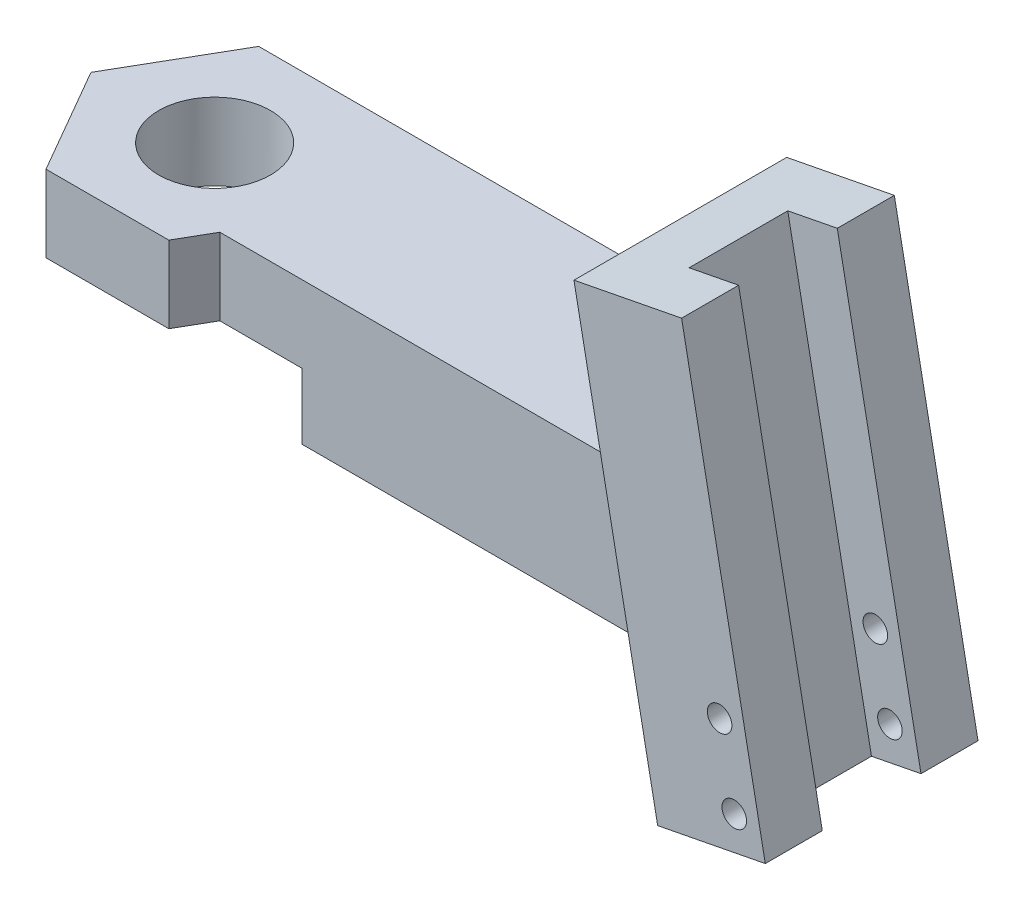
ISO-10303-21;
HEADER;
FILE_DESCRIPTION(('STEP AP214'),'2;1');
FILE_NAME('part.step','',(''),(''),'','','');
FILE_SCHEMA(('AUTOMOTIVE_DESIGN { 1 0 10303 214 1 1 1 1 }'));
ENDSEC;
DATA;
#1=APPLICATION_CONTEXT('core data for automotive mechanical design processes');
#2=APPLICATION_PROTOCOL_DEFINITION('international standard','automotive_design',2000,#1);
#3=PRODUCT_CONTEXT('',#1,'mechanical');
#4=PRODUCT('Part','Part','',(#3));
#5=PRODUCT_RELATED_PRODUCT_CATEGORY('part','',(#4));
#6=PRODUCT_DEFINITION_FORMATION('','',#4);
#7=PRODUCT_DEFINITION_CONTEXT('part definition',#1,'design');
#8=PRODUCT_DEFINITION('design','',#6,#7);
#9=PRODUCT_DEFINITION_SHAPE('','',#8);
#10=(LENGTH_UNIT() NAMED_UNIT(*) SI_UNIT(.MILLI.,.METRE.));
#11=(NAMED_UNIT(*) PLANE_ANGLE_UNIT() SI_UNIT($,.RADIAN.));
#12=(NAMED_UNIT(*) SI_UNIT($,.STERADIAN.) SOLID_ANGLE_UNIT());
#13=UNCERTAINTY_MEASURE_WITH_UNIT(LENGTH_MEASURE(1.E-05),#10,'distance_accuracy_value','');
#14=(GEOMETRIC_REPRESENTATION_CONTEXT(3) GLOBAL_UNCERTAINTY_ASSIGNED_CONTEXT((#13)) GLOBAL_UNIT_ASSIGNED_CONTEXT((#10,
#11,#12)) REPRESENTATION_CONTEXT('',''));
#15=CARTESIAN_POINT('',(0.,0.,0.));
#16=DIRECTION('',(0.,0.,1.));
#17=DIRECTION('',(1.,0.,0.));
#18=AXIS2_PLACEMENT_3D('',#15,#16,#17);
#19=CARTESIAN_POINT('',(2.80014880556968,-14.8169947470239,8.225));
#20=DIRECTION('',(0.866025403784439,0.,0.5));
#21=DIRECTION('',(0.5,0.,-0.866025403784439));
#22=AXIS2_PLACEMENT_3D('',#19,#20,#21);
#23=PLANE('',#22);
#24=DIRECTION('',(0.,1.,0.));
#25=VECTOR('',#24,1.);
#26=CARTESIAN_POINT('',(2.80014880556968,-14.8169947470239,8.225));
#27=LINE('',#26,#25);
#28=CARTESIAN_POINT('',(2.80014880556968,3.,8.225));
#29=VERTEX_POINT('',#28);
#30=CARTESIAN_POINT('',(2.80014880556968,6.5,8.225));
#31=VERTEX_POINT('',#30);
#32=EDGE_CURVE('E297',#29,#31,#27,.T.);
#33=ORIENTED_EDGE('',*,*,#32,.F.);
#34=DIRECTION('',(0.5,0.,-0.866025403784439));
#35=VECTOR('',#34,1.);
#36=CARTESIAN_POINT('',(2.80014880556968,3.,8.225));
#37=LINE('',#36,#35);
#38=CARTESIAN_POINT('',(3.65174045262438,3.,6.75));
#39=VERTEX_POINT('',#38);
#40=EDGE_CURVE('E201',#29,#39,#37,.T.);
#41=ORIENTED_EDGE('',*,*,#40,.T.);
#42=DIRECTION('',(0.,-1.,0.));
#43=VECTOR('',#42,1.);
#44=CARTESIAN_POINT('',(3.65174045262438,6.5,6.75));
#45=LINE('',#44,#43);
#46=CARTESIAN_POINT('',(3.65174045262438,6.5,6.75));
#47=VERTEX_POINT('',#46);
#48=EDGE_CURVE('E279',#47,#39,#45,.T.);
#49=ORIENTED_EDGE('',*,*,#48,.F.);
#50=DIRECTION('',(0.5,0.,-0.866025403784439));
#51=VECTOR('',#50,1.);
#52=CARTESIAN_POINT('',(2.80014880556968,6.5,8.225));
#53=LINE('',#52,#51);
#54=EDGE_CURVE('E289',#31,#47,#53,.T.);
#55=ORIENTED_EDGE('',*,*,#54,.F.);
#56=EDGE_LOOP('',(#33,#41,#49,#55));
#57=FACE_BOUND('',#56,.T.);
#58=ADVANCED_FACE('F37',(#57),#23,.T.);
#59=CARTESIAN_POINT('',(-2.80014880556969,-14.8169947470239,-1.475));
#60=DIRECTION('',(-0.866025403784439,0.,-0.5));
#61=DIRECTION('',(-0.5,0.,0.866025403784439));
#62=AXIS2_PLACEMENT_3D('',#59,#60,#61);
#63=PLANE('',#62);
#64=DIRECTION('',(0.,1.,0.));
#65=VECTOR('',#64,1.);
#66=CARTESIAN_POINT('',(-2.80014880556969,-14.8169947470239,-1.475));
#67=LINE('',#66,#65);
#68=CARTESIAN_POINT('',(-2.80014880556969,3.,-1.475));
#69=VERTEX_POINT('',#68);
#70=CARTESIAN_POINT('',(-2.80014880556969,6.5,-1.475));
#71=VERTEX_POINT('',#70);
#72=EDGE_CURVE('E280',#69,#71,#67,.T.);
#73=ORIENTED_EDGE('',*,*,#72,.F.);
#74=DIRECTION('',(-0.5,0.,0.866025403784439));
#75=VECTOR('',#74,1.);
#76=CARTESIAN_POINT('',(-2.80014880556969,3.,-1.475));
#77=LINE('',#76,#75);
#78=CARTESIAN_POINT('',(-5.60029761113937,3.,3.375));
#79=VERTEX_POINT('',#78);
#80=EDGE_CURVE('E198',#69,#79,#77,.T.);
#81=ORIENTED_EDGE('',*,*,#80,.T.);
#82=DIRECTION('',(0.,1.,0.));
#83=VECTOR('',#82,1.);
#84=CARTESIAN_POINT('',(-5.60029761113937,-14.8169947470239,3.375));
#85=LINE('',#84,#83);
#86=CARTESIAN_POINT('',(-5.60029761113937,6.5,3.375));
#87=VERTEX_POINT('',#86);
#88=EDGE_CURVE('E295',#79,#87,#85,.T.);
#89=ORIENTED_EDGE('',*,*,#88,.T.);
#90=DIRECTION('',(-0.5,0.,0.866025403784439));
#91=VECTOR('',#90,1.);
#92=CARTESIAN_POINT('',(-2.80014880556969,6.5,-1.475));
#93=LINE('',#92,#91);
#94=EDGE_CURVE('E277',#71,#87,#93,.T.);
#95=ORIENTED_EDGE('',*,*,#94,.F.);
#96=EDGE_LOOP('',(#73,#81,#89,#95));
#97=FACE_BOUND('',#96,.T.);
#98=ADVANCED_FACE('F360',(#97),#63,.T.);
#99=CARTESIAN_POINT('',(-2.80014880556968,-14.8169947470239,8.225));
#100=DIRECTION('',(0.,0.,1.));
#101=DIRECTION('',(1.,0.,0.));
#102=AXIS2_PLACEMENT_3D('',#99,#100,#101);
#103=PLANE('',#102);
#104=DIRECTION('',(0.,1.,0.));
#105=VECTOR('',#104,1.);
#106=CARTESIAN_POINT('',(-2.80014880556968,-14.8169947470239,8.225));
#107=LINE('',#106,#105);
#108=CARTESIAN_POINT('',(-2.80014880556968,3.,8.225));
#109=VERTEX_POINT('',#108);
#110=CARTESIAN_POINT('',(-2.80014880556968,6.5,8.225));
#111=VERTEX_POINT('',#110);
#112=EDGE_CURVE('E299',#109,#111,#107,.T.);
#113=ORIENTED_EDGE('',*,*,#112,.F.);
#114=DIRECTION('',(1.,0.,0.));
#115=VECTOR('',#114,1.);
#116=CARTESIAN_POINT('',(-2.80014880556968,3.,8.225));
#117=LINE('',#116,#115);
#118=EDGE_CURVE('E54',#109,#29,#117,.T.);
#119=ORIENTED_EDGE('',*,*,#118,.T.);
#120=ORIENTED_EDGE('',*,*,#32,.T.);
#121=DIRECTION('',(1.,0.,0.));
#122=VECTOR('',#121,1.);
#123=CARTESIAN_POINT('',(-2.80014880556968,6.5,8.225));
#124=LINE('',#123,#122);
#125=EDGE_CURVE('E286',#111,#31,#124,.T.);
#126=ORIENTED_EDGE('',*,*,#125,.F.);
#127=EDGE_LOOP('',(#113,#119,#120,#126));
#128=FACE_BOUND('',#127,.T.);
#129=ADVANCED_FACE('F354',(#128),#103,.T.);
#130=CARTESIAN_POINT('',(-5.60029761113937,-14.8169947470239,3.375));
#131=DIRECTION('',(-0.866025403784439,0.,0.5));
#132=DIRECTION('',(0.5,0.,0.866025403784439));
#133=AXIS2_PLACEMENT_3D('',#130,#131,#132);
#134=PLANE('',#133);
#135=ORIENTED_EDGE('',*,*,#88,.F.);
#136=DIRECTION('',(0.5,0.,0.866025403784439));
#137=VECTOR('',#136,1.);
#138=CARTESIAN_POINT('',(-5.60029761113937,3.,3.375));
#139=LINE('',#138,#137);
#140=EDGE_CURVE('E195',#79,#109,#139,.T.);
#141=ORIENTED_EDGE('',*,*,#140,.T.);
#142=ORIENTED_EDGE('',*,*,#112,.T.);
#143=DIRECTION('',(0.5,0.,0.866025403784439));
#144=VECTOR('',#143,1.);
#145=CARTESIAN_POINT('',(-5.60029761113937,6.5,3.375));
#146=LINE('',#145,#144);
#147=EDGE_CURVE('E283',#87,#111,#146,.T.);
#148=ORIENTED_EDGE('',*,*,#147,.F.);
#149=EDGE_LOOP('',(#135,#141,#142,#148));
#150=FACE_BOUND('',#149,.T.);
#151=ADVANCED_FACE('F358',(#150),#134,.T.);
#152=CARTESIAN_POINT('',(0.,-3.5,3.33561597332667));
#153=DIRECTION('',(0.,1.,0.));
#154=DIRECTION('',(0.,0.,1.));
#155=AXIS2_PLACEMENT_3D('',#152,#153,#154);
#156=CYLINDRICAL_SURFACE('',#155,2.55);
#157=CARTESIAN_POINT('',(0.,6.5,3.33561597332667));
#158=DIRECTION('',(0.,1.,0.));
#159=DIRECTION('',(0.,0.,1.));
#160=AXIS2_PLACEMENT_3D('',#157,#158,#159);
#161=CIRCLE('',#160,2.55);
#162=CARTESIAN_POINT('',(0.,6.5,5.88561597332667));
#163=VERTEX_POINT('',#162);
#164=EDGE_CURVE('E208',#163,#163,#161,.T.);
#165=ORIENTED_EDGE('',*,*,#164,.T.);
#166=EDGE_LOOP('',(#165));
#167=FACE_BOUND('',#166,.T.);
#168=CARTESIAN_POINT('',(0.,3.,3.33561597332667));
#169=DIRECTION('',(0.,-1.,0.));
#170=DIRECTION('',(0.,0.,-1.));
#171=AXIS2_PLACEMENT_3D('',#168,#169,#170);
#172=CIRCLE('',#171,2.55);
#173=CARTESIAN_POINT('',(0.,3.,0.78561597332667));
#174=VERTEX_POINT('',#173);
#175=EDGE_CURVE('E182',#174,#174,#172,.F.);
#176=ORIENTED_EDGE('',*,*,#175,.F.);
#177=EDGE_LOOP('',(#176));
#178=FACE_BOUND('',#177,.T.);
#179=ADVANCED_FACE('F388',(#167,#178),#156,.F.);
#180=CARTESIAN_POINT('',(30.,-4.52297751155863,-23.8339203380482));
#181=DIRECTION('',(0.190808995376549,-0.981627183447663,0.));
#182=DIRECTION('',(0.981627183447663,0.190808995376549,0.));
#183=AXIS2_PLACEMENT_3D('',#180,#181,#182);
#184=PLANE('',#183);
#185=DIRECTION('',(0.981627183447663,0.190808995376549,0.));
#186=VECTOR('',#185,1.);
#187=CARTESIAN_POINT('',(30.,-4.52297751155863,8.225));
#188=LINE('',#187,#186);
#189=CARTESIAN_POINT('',(25.0918640827617,-5.47702248844137,8.225));
#190=VERTEX_POINT('',#189);
#191=CARTESIAN_POINT('',(30.,-4.52297751155863,8.225));
#192=VERTEX_POINT('',#191);
#193=EDGE_CURVE('E242',#190,#192,#188,.T.);
#194=ORIENTED_EDGE('',*,*,#193,.F.);
#195=DIRECTION('',(0.,0.,1.));
#196=VECTOR('',#195,1.);
#197=CARTESIAN_POINT('',(25.0918640827617,-5.47702248844137,-23.8339203380482));
#198=LINE('',#197,#196);
#199=CARTESIAN_POINT('',(25.0918640827617,-5.47702248844137,-1.475));
#200=VERTEX_POINT('',#199);
#201=EDGE_CURVE('E256',#200,#190,#198,.T.);
#202=ORIENTED_EDGE('',*,*,#201,.F.);
#203=DIRECTION('',(0.981627183447663,0.190808995376549,0.));
#204=VECTOR('',#203,1.);
#205=CARTESIAN_POINT('',(30.,-4.52297751155863,-1.475));
#206=LINE('',#205,#204);
#207=CARTESIAN_POINT('',(30.,-4.52297751155863,-1.475));
#208=VERTEX_POINT('',#207);
#209=EDGE_CURVE('E241',#200,#208,#206,.T.);
#210=ORIENTED_EDGE('',*,*,#209,.T.);
#211=DIRECTION('',(0.,0.,1.));
#212=VECTOR('',#211,1.);
#213=CARTESIAN_POINT('',(30.,-4.52297751155863,-23.8339203380482));
#214=LINE('',#213,#212);
#215=CARTESIAN_POINT('',(30.,-4.52297751155862,1.12499999999999));
#216=VERTEX_POINT('',#215);
#217=EDGE_CURVE('E267',#208,#216,#214,.T.);
#218=ORIENTED_EDGE('',*,*,#217,.T.);
#219=DIRECTION('',(-0.981627183447663,-0.190808995376549,0.));
#220=VECTOR('',#219,1.);
#221=CARTESIAN_POINT('',(30.0000000000001,-4.52297751155861,1.12499999999999));
#222=LINE('',#221,#220);
#223=CARTESIAN_POINT('',(27.7422574780704,-4.96183820092469,1.125));
#224=VERTEX_POINT('',#223);
#225=EDGE_CURVE('E234',#216,#224,#222,.T.);
#226=ORIENTED_EDGE('',*,*,#225,.T.);
#227=DIRECTION('',(0.,0.,-1.));
#228=VECTOR('',#227,1.);
#229=CARTESIAN_POINT('',(27.7422574780704,-4.96183820092469,-23.8339203380482));
#230=LINE('',#229,#228);
#231=CARTESIAN_POINT('',(27.7422574780704,-4.96183820092469,5.625));
#232=VERTEX_POINT('',#231);
#233=EDGE_CURVE('E230',#232,#224,#230,.T.);
#234=ORIENTED_EDGE('',*,*,#233,.F.);
#235=DIRECTION('',(-0.981627183447663,-0.190808995376549,0.));
#236=VECTOR('',#235,1.);
#237=CARTESIAN_POINT('',(29.9999999999999,-4.52297751155864,5.62500000000001));
#238=LINE('',#237,#236);
#239=CARTESIAN_POINT('',(30.,-4.52297751155862,5.625));
#240=VERTEX_POINT('',#239);
#241=EDGE_CURVE('E232',#240,#232,#238,.T.);
#242=ORIENTED_EDGE('',*,*,#241,.F.);
#243=EDGE_CURVE('E252',#240,#192,#214,.T.);
#244=ORIENTED_EDGE('',*,*,#243,.T.);
#245=EDGE_LOOP('',(#194,#202,#210,#218,#226,#234,#242,#244));
#246=FACE_BOUND('',#245,.T.);
#247=ADVANCED_FACE('F381',(#246),#184,.T.);
#248=CARTESIAN_POINT('',(26.183820092469,15.1095661573946,-23.8339203380482));
#249=DIRECTION('',(0.981627183447663,0.190808995376549,0.));
#250=DIRECTION('',(-0.190808995376549,0.981627183447663,0.));
#251=AXIS2_PLACEMENT_3D('',#248,#249,#250);
#252=PLANE('',#251);
#253=DIRECTION('',(-0.190808995376549,0.981627183447663,0.));
#254=VECTOR('',#253,1.);
#255=CARTESIAN_POINT('',(30.5724269861296,-7.4678590619016,1.12499999999999));
#256=LINE('',#255,#254);
#257=CARTESIAN_POINT('',(26.183820092469,15.1095661573946,1.12499999999999));
#258=VERTEX_POINT('',#257);
#259=EDGE_CURVE('E227',#216,#258,#256,.T.);
#260=ORIENTED_EDGE('',*,*,#259,.F.);
#261=ORIENTED_EDGE('',*,*,#217,.F.);
#262=DIRECTION('',(-0.190808995376549,0.981627183447663,0.));
#263=VECTOR('',#262,1.);
#264=CARTESIAN_POINT('',(26.183820092469,15.1095661573946,-1.475));
#265=LINE('',#264,#263);
#266=CARTESIAN_POINT('',(26.183820092469,15.1095661573946,-1.475));
#267=VERTEX_POINT('',#266);
#268=EDGE_CURVE('E263',#208,#267,#265,.T.);
#269=ORIENTED_EDGE('',*,*,#268,.T.);
#270=DIRECTION('',(0.,0.,1.));
#271=VECTOR('',#270,1.);
#272=CARTESIAN_POINT('',(26.183820092469,15.1095661573946,-23.8339203380482));
#273=LINE('',#272,#271);
#274=EDGE_CURVE('E262',#267,#258,#273,.T.);
#275=ORIENTED_EDGE('',*,*,#274,.T.);
#276=EDGE_LOOP('',(#260,#261,#269,#275));
#277=FACE_BOUND('',#276,.T.);
#278=ADVANCED_FACE('F377',(#277),#252,.T.);
#279=CARTESIAN_POINT('',(21.2756841752307,14.1555211805119,-23.8339203380482));
#280=DIRECTION('',(-0.190808995376549,0.981627183447663,0.));
#281=DIRECTION('',(-0.981627183447663,-0.190808995376549,0.));
#282=AXIS2_PLACEMENT_3D('',#279,#280,#281);
#283=PLANE('',#282);
#284=DIRECTION('',(0.981627183447663,0.190808995376549,0.));
#285=VECTOR('',#284,1.);
#286=CARTESIAN_POINT('',(23.9260775705394,14.6707054680286,1.125));
#287=LINE('',#286,#285);
#288=CARTESIAN_POINT('',(23.9260775705394,14.6707054680286,1.125));
#289=VERTEX_POINT('',#288);
#290=EDGE_CURVE('E211',#289,#258,#287,.T.);
#291=ORIENTED_EDGE('',*,*,#290,.T.);
#292=ORIENTED_EDGE('',*,*,#274,.F.);
#293=DIRECTION('',(-0.981627183447663,-0.190808995376549,0.));
#294=VECTOR('',#293,1.);
#295=CARTESIAN_POINT('',(21.2756841752307,14.1555211805119,-1.475));
#296=LINE('',#295,#294);
#297=CARTESIAN_POINT('',(21.2756841752307,14.1555211805119,-1.475));
#298=VERTEX_POINT('',#297);
#299=EDGE_CURVE('E258',#267,#298,#296,.T.);
#300=ORIENTED_EDGE('',*,*,#299,.T.);
#301=DIRECTION('',(0.,0.,1.));
#302=VECTOR('',#301,1.);
#303=CARTESIAN_POINT('',(21.2756841752307,14.1555211805119,-23.8339203380482));
#304=LINE('',#303,#302);
#305=CARTESIAN_POINT('',(21.2756841752307,14.1555211805119,8.225));
#306=VERTEX_POINT('',#305);
#307=EDGE_CURVE('E261',#298,#306,#304,.T.);
#308=ORIENTED_EDGE('',*,*,#307,.T.);
#309=DIRECTION('',(-0.981627183447663,-0.190808995376549,0.));
#310=VECTOR('',#309,1.);
#311=CARTESIAN_POINT('',(21.2756841752307,14.1555211805119,8.225));
#312=LINE('',#311,#310);
#313=CARTESIAN_POINT('',(26.183820092469,15.1095661573946,8.225));
#314=VERTEX_POINT('',#313);
#315=EDGE_CURVE('E237',#314,#306,#312,.T.);
#316=ORIENTED_EDGE('',*,*,#315,.F.);
#317=CARTESIAN_POINT('',(26.183820092469,15.1095661573946,5.625));
#318=VERTEX_POINT('',#317);
#319=EDGE_CURVE('E266',#318,#314,#273,.T.);
#320=ORIENTED_EDGE('',*,*,#319,.F.);
#321=DIRECTION('',(0.981627183447663,0.190808995376549,0.));
#322=VECTOR('',#321,1.);
#323=CARTESIAN_POINT('',(23.9260775705394,14.6707054680286,5.625));
#324=LINE('',#323,#322);
#325=CARTESIAN_POINT('',(23.9260775705394,14.6707054680286,5.625));
#326=VERTEX_POINT('',#325);
#327=EDGE_CURVE('E214',#326,#318,#324,.T.);
#328=ORIENTED_EDGE('',*,*,#327,.F.);
#329=DIRECTION('',(0.,0.,1.));
#330=VECTOR('',#329,1.);
#331=CARTESIAN_POINT('',(23.9260775705394,14.6707054680286,1.125));
#332=LINE('',#331,#330);
#333=EDGE_CURVE('E216',#289,#326,#332,.T.);
#334=ORIENTED_EDGE('',*,*,#333,.F.);
#335=EDGE_LOOP('',(#291,#292,#300,#308,#316,#320,#328,#334));
#336=FACE_BOUND('',#335,.T.);
#337=ADVANCED_FACE('F371',(#336),#283,.T.);
#338=DIRECTION('',(-0.190808995376549,0.981627183447663,0.));
#339=VECTOR('',#338,1.);
#340=CARTESIAN_POINT('',(30.5724269861296,-7.4678590619016,5.625));
#341=LINE('',#340,#339);
#342=EDGE_CURVE('E224',#240,#318,#341,.T.);
#343=ORIENTED_EDGE('',*,*,#342,.T.);
#344=ORIENTED_EDGE('',*,*,#319,.T.);
#345=DIRECTION('',(-0.190808995376549,0.981627183447663,0.));
#346=VECTOR('',#345,1.);
#347=CARTESIAN_POINT('',(26.183820092469,15.1095661573946,8.225));
#348=LINE('',#347,#346);
#349=EDGE_CURVE('E238',#192,#314,#348,.T.);
#350=ORIENTED_EDGE('',*,*,#349,.F.);
#351=ORIENTED_EDGE('',*,*,#243,.F.);
#352=EDGE_LOOP('',(#343,#344,#350,#351));
#353=FACE_BOUND('',#352,.T.);
#354=ADVANCED_FACE('F535',(#353),#252,.T.);
#355=CARTESIAN_POINT('',(25.0918640827617,-5.47702248844137,-23.8339203380482));
#356=DIRECTION('',(-0.981627183447663,-0.19080899537655,0.));
#357=DIRECTION('',(0.19080899537655,-0.981627183447663,0.));
#358=AXIS2_PLACEMENT_3D('',#355,#356,#357);
#359=PLANE('',#358);
#360=DIRECTION('',(0.19080899537655,-0.981627183447663,0.));
#361=VECTOR('',#360,1.);
#362=CARTESIAN_POINT('',(25.0918640827617,-5.47702248844137,8.225));
#363=LINE('',#362,#361);
#364=EDGE_CURVE('E245',#306,#190,#363,.T.);
#365=ORIENTED_EDGE('',*,*,#364,.F.);
#366=ORIENTED_EDGE('',*,*,#307,.F.);
#367=DIRECTION('',(0.19080899537655,-0.981627183447663,0.));
#368=VECTOR('',#367,1.);
#369=CARTESIAN_POINT('',(25.0918640827617,-5.47702248844137,-1.475));
#370=LINE('',#369,#368);
#371=CARTESIAN_POINT('',(22.763766748909,6.5,-1.475));
#372=VERTEX_POINT('',#371);
#373=EDGE_CURVE('E253',#298,#372,#370,.T.);
#374=ORIENTED_EDGE('',*,*,#373,.T.);
#375=DIRECTION('',(0.,0.,1.));
#376=VECTOR('',#375,1.);
#377=CARTESIAN_POINT('',(22.763766748909,6.5,0.));
#378=LINE('',#377,#376);
#379=CARTESIAN_POINT('',(22.763766748909,6.5,6.75));
#380=VERTEX_POINT('',#379);
#381=EDGE_CURVE('E275',#372,#380,#378,.T.);
#382=ORIENTED_EDGE('',*,*,#381,.T.);
#383=DIRECTION('',(-0.19080899537655,0.981627183447663,0.));
#384=VECTOR('',#383,1.);
#385=CARTESIAN_POINT('',(21.9349818738108,10.7637285575617,6.75));
#386=LINE('',#385,#384);
#387=CARTESIAN_POINT('',(24.0272387583042,0.,6.75));
#388=VERTEX_POINT('',#387);
#389=EDGE_CURVE('E272',#388,#380,#386,.T.);
#390=ORIENTED_EDGE('',*,*,#389,.F.);
#391=DIRECTION('',(0.,0.,1.));
#392=VECTOR('',#391,1.);
#393=CARTESIAN_POINT('',(24.0272387583042,0.,0.));
#394=LINE('',#393,#392);
#395=CARTESIAN_POINT('',(24.0272387583042,0.,-1.475));
#396=VERTEX_POINT('',#395);
#397=EDGE_CURVE('E46',#396,#388,#394,.T.);
#398=ORIENTED_EDGE('',*,*,#397,.F.);
#399=EDGE_CURVE('E257',#396,#200,#370,.T.);
#400=ORIENTED_EDGE('',*,*,#399,.T.);
#401=ORIENTED_EDGE('',*,*,#201,.T.);
#402=EDGE_LOOP('',(#365,#366,#374,#382,#390,#398,#400,#401));
#403=FACE_BOUND('',#402,.T.);
#404=ADVANCED_FACE('F367',(#403),#359,.T.);
#405=CARTESIAN_POINT('',(-2.80014880556968,-14.8169947470239,8.225));
#406=DIRECTION('',(0.,0.,1.));
#407=DIRECTION('',(1.,0.,0.));
#408=AXIS2_PLACEMENT_3D('',#405,#406,#407);
#409=PLANE('',#408);
#410=CARTESIAN_POINT('',(28.5849152459704,-3.26996708107016,8.225));
#411=DIRECTION('',(0.,0.,1.));
#412=DIRECTION('',(1.,0.,0.));
#413=AXIS2_PLACEMENT_3D('',#410,#411,#412);
#414=CIRCLE('',#413,0.560000000000003);
#415=CARTESIAN_POINT('',(29.1449152459704,-3.26996708107016,8.225));
#416=VERTEX_POINT('',#415);
#417=EDGE_CURVE('E314',#416,#416,#414,.F.);
#418=ORIENTED_EDGE('',*,*,#417,.T.);
#419=EDGE_LOOP('',(#418));
#420=FACE_BOUND('',#419,.T.);
#421=CARTESIAN_POINT('',(27.9170837621524,0.165728060996657,8.225));
#422=DIRECTION('',(0.,0.,1.));
#423=DIRECTION('',(1.,0.,0.));
#424=AXIS2_PLACEMENT_3D('',#421,#422,#423);
#425=CIRCLE('',#424,0.560000000000003);
#426=CARTESIAN_POINT('',(28.4770837621524,0.165728060996657,8.225));
#427=VERTEX_POINT('',#426);
#428=EDGE_CURVE('E327',#427,#427,#425,.F.);
#429=ORIENTED_EDGE('',*,*,#428,.T.);
#430=EDGE_LOOP('',(#429));
#431=FACE_BOUND('',#430,.T.);
#432=ORIENTED_EDGE('',*,*,#315,.T.);
#433=ORIENTED_EDGE('',*,*,#364,.T.);
#434=ORIENTED_EDGE('',*,*,#193,.T.);
#435=ORIENTED_EDGE('',*,*,#349,.T.);
#436=EDGE_LOOP('',(#432,#433,#434,#435));
#437=FACE_BOUND('',#436,.T.);
#438=ADVANCED_FACE('F476',(#420,#431,#437),#409,.T.);
#439=CARTESIAN_POINT('',(0.,6.5,6.75));
#440=DIRECTION('',(0.,0.,-1.));
#441=DIRECTION('',(-1.,0.,0.));
#442=AXIS2_PLACEMENT_3D('',#439,#440,#441);
#443=PLANE('',#442);
#444=DIRECTION('',(-1.,0.,0.));
#445=VECTOR('',#444,1.);
#446=CARTESIAN_POINT('',(0.,3.,6.75));
#447=LINE('',#446,#445);
#448=CARTESIAN_POINT('',(7.40451720235695,3.,6.75));
#449=VERTEX_POINT('',#448);
#450=EDGE_CURVE('E204',#449,#39,#447,.T.);
#451=ORIENTED_EDGE('',*,*,#450,.F.);
#452=DIRECTION('',(0.,-1.,0.));
#453=VECTOR('',#452,1.);
#454=CARTESIAN_POINT('',(7.40451720235695,6.5,6.75));
#455=LINE('',#454,#453);
#456=CARTESIAN_POINT('',(7.40451720235695,0.,6.75));
#457=VERTEX_POINT('',#456);
#458=EDGE_CURVE('E186',#449,#457,#455,.T.);
#459=ORIENTED_EDGE('',*,*,#458,.T.);
#460=DIRECTION('',(1.,0.,0.));
#461=VECTOR('',#460,1.);
#462=CARTESIAN_POINT('',(0.,0.,6.75));
#463=LINE('',#462,#461);
#464=EDGE_CURVE('E304',#457,#388,#463,.T.);
#465=ORIENTED_EDGE('',*,*,#464,.T.);
#466=ORIENTED_EDGE('',*,*,#389,.T.);
#467=DIRECTION('',(1.,0.,0.));
#468=VECTOR('',#467,1.);
#469=CARTESIAN_POINT('',(0.,6.5,6.75));
#470=LINE('',#469,#468);
#471=EDGE_CURVE('E305',#47,#380,#470,.T.);
#472=ORIENTED_EDGE('',*,*,#471,.F.);
#473=ORIENTED_EDGE('',*,*,#48,.T.);
#474=EDGE_LOOP('',(#451,#459,#465,#466,#472,#473));
#475=FACE_BOUND('',#474,.T.);
#476=ADVANCED_FACE('F39',(#475),#443,.F.);
#477=CARTESIAN_POINT('',(0.,6.5,0.));
#478=DIRECTION('',(0.,1.,0.));
#479=DIRECTION('',(0.,0.,1.));
#480=AXIS2_PLACEMENT_3D('',#477,#478,#479);
#481=PLANE('',#480);
#482=ORIENTED_EDGE('',*,*,#381,.F.);
#483=DIRECTION('',(-1.,0.,0.));
#484=VECTOR('',#483,1.);
#485=CARTESIAN_POINT('',(2.80014880556968,6.5,-1.475));
#486=LINE('',#485,#484);
#487=EDGE_CURVE('E292',#372,#71,#486,.T.);
#488=ORIENTED_EDGE('',*,*,#487,.T.);
#489=ORIENTED_EDGE('',*,*,#94,.T.);
#490=ORIENTED_EDGE('',*,*,#147,.T.);
#491=ORIENTED_EDGE('',*,*,#125,.T.);
#492=ORIENTED_EDGE('',*,*,#54,.T.);
#493=ORIENTED_EDGE('',*,*,#471,.T.);
#494=EDGE_LOOP('',(#482,#488,#489,#490,#491,#492,#493));
#495=FACE_BOUND('',#494,.T.);
#496=ORIENTED_EDGE('',*,*,#164,.F.);
#497=EDGE_LOOP('',(#496));
#498=FACE_BOUND('',#497,.T.);
#499=ADVANCED_FACE('F382',(#495,#498),#481,.T.);
#500=CARTESIAN_POINT('',(0.,0.,0.));
#501=DIRECTION('',(0.,1.,0.));
#502=DIRECTION('',(0.,0.,1.));
#503=AXIS2_PLACEMENT_3D('',#500,#501,#502);
#504=PLANE('',#503);
#505=ORIENTED_EDGE('',*,*,#464,.F.);
#506=DIRECTION('',(-0.5,0.,0.866025403784439));
#507=VECTOR('',#506,1.);
#508=CARTESIAN_POINT('',(9.35307436087194,0.,3.375));
#509=LINE('',#508,#507);
#510=CARTESIAN_POINT('',(9.35307436087194,0.,3.375));
#511=VERTEX_POINT('',#510);
#512=EDGE_CURVE('E188',#511,#457,#509,.T.);
#513=ORIENTED_EDGE('',*,*,#512,.F.);
#514=DIRECTION('',(0.5,0.,0.866025403784439));
#515=VECTOR('',#514,1.);
#516=CARTESIAN_POINT('',(4.67653718043597,0.,-4.725));
#517=LINE('',#516,#515);
#518=CARTESIAN_POINT('',(6.55292555530225,0.,-1.475));
#519=VERTEX_POINT('',#518);
#520=EDGE_CURVE('E179',#519,#511,#517,.T.);
#521=ORIENTED_EDGE('',*,*,#520,.F.);
#522=DIRECTION('',(1.,0.,0.));
#523=VECTOR('',#522,1.);
#524=CARTESIAN_POINT('',(2.80014880556968,0.,-1.475));
#525=LINE('',#524,#523);
#526=EDGE_CURVE('E62',#519,#396,#525,.T.);
#527=ORIENTED_EDGE('',*,*,#526,.T.);
#528=ORIENTED_EDGE('',*,*,#397,.T.);
#529=EDGE_LOOP('',(#505,#513,#521,#527,#528));
#530=FACE_BOUND('',#529,.T.);
#531=ADVANCED_FACE('F339',(#530),#504,.F.);
#532=CARTESIAN_POINT('',(2.80014880556968,-14.8169947470239,-1.475));
#533=DIRECTION('',(0.,0.,-1.));
#534=DIRECTION('',(-1.,0.,0.));
#535=AXIS2_PLACEMENT_3D('',#532,#533,#534);
#536=PLANE('',#535);
#537=CARTESIAN_POINT('',(28.5849152459704,-3.26996708107016,-1.475));
#538=DIRECTION('',(0.,0.,-1.));
#539=DIRECTION('',(-1.,0.,0.));
#540=AXIS2_PLACEMENT_3D('',#537,#538,#539);
#541=CIRCLE('',#540,0.560000000000003);
#542=CARTESIAN_POINT('',(28.0249152459704,-3.26996708107016,-1.475));
#543=VERTEX_POINT('',#542);
#544=EDGE_CURVE('E319',#543,#543,#541,.T.);
#545=ORIENTED_EDGE('',*,*,#544,.F.);
#546=EDGE_LOOP('',(#545));
#547=FACE_BOUND('',#546,.T.);
#548=CARTESIAN_POINT('',(27.9170837621524,0.165728060996657,-1.475));
#549=DIRECTION('',(0.,0.,-1.));
#550=DIRECTION('',(-1.,0.,0.));
#551=AXIS2_PLACEMENT_3D('',#548,#549,#550);
#552=CIRCLE('',#551,0.560000000000003);
#553=CARTESIAN_POINT('',(27.3570837621524,0.165728060996657,-1.475));
#554=VERTEX_POINT('',#553);
#555=EDGE_CURVE('E324',#554,#554,#552,.T.);
#556=ORIENTED_EDGE('',*,*,#555,.F.);
#557=EDGE_LOOP('',(#556));
#558=FACE_BOUND('',#557,.T.);
#559=DIRECTION('',(0.,-1.,0.));
#560=VECTOR('',#559,1.);
#561=CARTESIAN_POINT('',(6.55292555530225,-14.8169947470239,-1.475));
#562=LINE('',#561,#560);
#563=CARTESIAN_POINT('',(6.55292555530225,3.,-1.475));
#564=VERTEX_POINT('',#563);
#565=EDGE_CURVE('E11',#564,#519,#562,.T.);
#566=ORIENTED_EDGE('',*,*,#565,.F.);
#567=DIRECTION('',(-1.,0.,0.));
#568=VECTOR('',#567,1.);
#569=CARTESIAN_POINT('',(2.80014880556968,3.,-1.475));
#570=LINE('',#569,#568);
#571=EDGE_CURVE('E172',#564,#69,#570,.T.);
#572=ORIENTED_EDGE('',*,*,#571,.T.);
#573=ORIENTED_EDGE('',*,*,#72,.T.);
#574=ORIENTED_EDGE('',*,*,#487,.F.);
#575=ORIENTED_EDGE('',*,*,#373,.F.);
#576=ORIENTED_EDGE('',*,*,#299,.F.);
#577=ORIENTED_EDGE('',*,*,#268,.F.);
#578=ORIENTED_EDGE('',*,*,#209,.F.);
#579=ORIENTED_EDGE('',*,*,#399,.F.);
#580=ORIENTED_EDGE('',*,*,#526,.F.);
#581=EDGE_LOOP('',(#566,#572,#573,#574,#575,#576,#577,#578,#579,#580));
#582=FACE_BOUND('',#581,.T.);
#583=ADVANCED_FACE('F335',(#547,#558,#582),#536,.T.);
#584=CARTESIAN_POINT('',(28.3146844642,-7.90671975126767,1.125));
#585=DIRECTION('',(0.,0.,1.));
#586=DIRECTION('',(1.,0.,0.));
#587=AXIS2_PLACEMENT_3D('',#584,#585,#586);
#588=PLANE('',#587);
#589=CARTESIAN_POINT('',(28.5849152459704,-3.26996708107016,1.12499999999999));
#590=DIRECTION('',(0.,0.,1.));
#591=DIRECTION('',(1.,0.,0.));
#592=AXIS2_PLACEMENT_3D('',#589,#590,#591);
#593=CIRCLE('',#592,0.560000000000003);
#594=CARTESIAN_POINT('',(29.1449152459704,-3.26996708107016,1.12499999999999));
#595=VERTEX_POINT('',#594);
#596=EDGE_CURVE('E191',#595,#595,#593,.T.);
#597=ORIENTED_EDGE('',*,*,#596,.F.);
#598=EDGE_LOOP('',(#597));
#599=FACE_BOUND('',#598,.T.);
#600=CARTESIAN_POINT('',(27.9170837621524,0.165728060996657,1.12499999999999));
#601=DIRECTION('',(0.,0.,1.));
#602=DIRECTION('',(1.,0.,0.));
#603=AXIS2_PLACEMENT_3D('',#600,#601,#602);
#604=CIRCLE('',#603,0.560000000000003);
#605=CARTESIAN_POINT('',(28.4770837621524,0.165728060996657,1.12499999999999));
#606=VERTEX_POINT('',#605);
#607=EDGE_CURVE('E313',#606,#606,#604,.T.);
#608=ORIENTED_EDGE('',*,*,#607,.F.);
#609=EDGE_LOOP('',(#608));
#610=FACE_BOUND('',#609,.T.);
#611=ORIENTED_EDGE('',*,*,#259,.T.);
#612=ORIENTED_EDGE('',*,*,#290,.F.);
#613=DIRECTION('',(-0.190808995376549,0.981627183447663,0.));
#614=VECTOR('',#613,1.);
#615=CARTESIAN_POINT('',(28.3146844642,-7.90671975126767,1.125));
#616=LINE('',#615,#614);
#617=EDGE_CURVE('E219',#224,#289,#616,.T.);
#618=ORIENTED_EDGE('',*,*,#617,.F.);
#619=ORIENTED_EDGE('',*,*,#225,.F.);
#620=EDGE_LOOP('',(#611,#612,#618,#619));
#621=FACE_BOUND('',#620,.T.);
#622=ADVANCED_FACE('F338',(#599,#610,#621),#588,.T.);
#623=CARTESIAN_POINT('',(28.3146844642,-7.90671975126767,5.625));
#624=DIRECTION('',(0.,0.,1.));
#625=DIRECTION('',(1.,0.,0.));
#626=AXIS2_PLACEMENT_3D('',#623,#624,#625);
#627=PLANE('',#626);
#628=CARTESIAN_POINT('',(28.5849152459704,-3.26996708107016,5.625));
#629=DIRECTION('',(0.,0.,1.));
#630=DIRECTION('',(1.,0.,0.));
#631=AXIS2_PLACEMENT_3D('',#628,#629,#630);
#632=CIRCLE('',#631,0.560000000000003);
#633=CARTESIAN_POINT('',(29.1449152459704,-3.26996708107016,5.625));
#634=VERTEX_POINT('',#633);
#635=EDGE_CURVE('E41',#634,#634,#632,.T.);
#636=ORIENTED_EDGE('',*,*,#635,.T.);
#637=EDGE_LOOP('',(#636));
#638=FACE_BOUND('',#637,.T.);
#639=CARTESIAN_POINT('',(27.9170837621524,0.165728060996657,5.625));
#640=DIRECTION('',(0.,0.,1.));
#641=DIRECTION('',(1.,0.,0.));
#642=AXIS2_PLACEMENT_3D('',#639,#640,#641);
#643=CIRCLE('',#642,0.560000000000003);
#644=CARTESIAN_POINT('',(28.4770837621524,0.165728060996657,5.625));
#645=VERTEX_POINT('',#644);
#646=EDGE_CURVE('E311',#645,#645,#643,.T.);
#647=ORIENTED_EDGE('',*,*,#646,.T.);
#648=EDGE_LOOP('',(#647));
#649=FACE_BOUND('',#648,.T.);
#650=ORIENTED_EDGE('',*,*,#241,.T.);
#651=DIRECTION('',(-0.190808995376549,0.981627183447663,0.));
#652=VECTOR('',#651,1.);
#653=CARTESIAN_POINT('',(28.3146844642,-7.90671975126767,5.625));
#654=LINE('',#653,#652);
#655=EDGE_CURVE('E222',#232,#326,#654,.T.);
#656=ORIENTED_EDGE('',*,*,#655,.T.);
#657=ORIENTED_EDGE('',*,*,#327,.T.);
#658=ORIENTED_EDGE('',*,*,#342,.F.);
#659=EDGE_LOOP('',(#650,#656,#657,#658));
#660=FACE_BOUND('',#659,.T.);
#661=ADVANCED_FACE('F434',(#638,#649,#660),#627,.F.);
#662=CARTESIAN_POINT('',(28.3146844642,-7.90671975126767,1.125));
#663=DIRECTION('',(-0.981627183447663,-0.190808995376549,0.));
#664=DIRECTION('',(0.190808995376549,-0.981627183447663,0.));
#665=AXIS2_PLACEMENT_3D('',#662,#663,#664);
#666=PLANE('',#665);
#667=ORIENTED_EDGE('',*,*,#233,.T.);
#668=ORIENTED_EDGE('',*,*,#617,.T.);
#669=ORIENTED_EDGE('',*,*,#333,.T.);
#670=ORIENTED_EDGE('',*,*,#655,.F.);
#671=EDGE_LOOP('',(#667,#668,#669,#670));
#672=FACE_BOUND('',#671,.T.);
#673=ADVANCED_FACE('F401',(#672),#666,.F.);
#674=CARTESIAN_POINT('',(9.35307436087194,3.,3.375));
#675=DIRECTION('',(0.866025403784438,0.,0.5));
#676=DIRECTION('',(0.5,0.,-0.866025403784439));
#677=AXIS2_PLACEMENT_3D('',#674,#675,#676);
#678=PLANE('',#677);
#679=DIRECTION('',(-0.5,0.,0.866025403784439));
#680=VECTOR('',#679,1.);
#681=CARTESIAN_POINT('',(9.35307436087194,3.,3.375));
#682=LINE('',#681,#680);
#683=CARTESIAN_POINT('',(9.35307436087194,3.,3.375));
#684=VERTEX_POINT('',#683);
#685=EDGE_CURVE('E169',#684,#449,#682,.T.);
#686=ORIENTED_EDGE('',*,*,#685,.F.);
#687=DIRECTION('',(0.,-1.,0.));
#688=VECTOR('',#687,1.);
#689=CARTESIAN_POINT('',(9.35307436087194,3.,3.375));
#690=LINE('',#689,#688);
#691=EDGE_CURVE('E175',#684,#511,#690,.T.);
#692=ORIENTED_EDGE('',*,*,#691,.T.);
#693=ORIENTED_EDGE('',*,*,#512,.T.);
#694=ORIENTED_EDGE('',*,*,#458,.F.);
#695=EDGE_LOOP('',(#686,#692,#693,#694));
#696=FACE_BOUND('',#695,.T.);
#697=ADVANCED_FACE('F184',(#696),#678,.F.);
#698=CARTESIAN_POINT('',(0.,3.,0.));
#699=DIRECTION('',(0.,-1.,0.));
#700=DIRECTION('',(0.,0.,-1.));
#701=AXIS2_PLACEMENT_3D('',#698,#699,#700);
#702=PLANE('',#701);
#703=DIRECTION('',(0.5,0.,0.866025403784439));
#704=VECTOR('',#703,1.);
#705=CARTESIAN_POINT('',(4.67653718043597,3.,-4.725));
#706=LINE('',#705,#704);
#707=EDGE_CURVE('E164',#564,#684,#706,.T.);
#708=ORIENTED_EDGE('',*,*,#707,.T.);
#709=ORIENTED_EDGE('',*,*,#685,.T.);
#710=ORIENTED_EDGE('',*,*,#450,.T.);
#711=ORIENTED_EDGE('',*,*,#40,.F.);
#712=ORIENTED_EDGE('',*,*,#118,.F.);
#713=ORIENTED_EDGE('',*,*,#140,.F.);
#714=ORIENTED_EDGE('',*,*,#80,.F.);
#715=ORIENTED_EDGE('',*,*,#571,.F.);
#716=EDGE_LOOP('',(#708,#709,#710,#711,#712,#713,#714,#715));
#717=FACE_BOUND('',#716,.T.);
#718=ORIENTED_EDGE('',*,*,#175,.T.);
#719=EDGE_LOOP('',(#718));
#720=FACE_BOUND('',#719,.T.);
#721=ADVANCED_FACE('F166',(#717,#720),#702,.T.);
#722=CARTESIAN_POINT('',(4.67653718043597,3.,-4.725));
#723=DIRECTION('',(0.866025403784439,0.,-0.5));
#724=DIRECTION('',(-0.5,0.,-0.866025403784439));
#725=AXIS2_PLACEMENT_3D('',#722,#723,#724);
#726=PLANE('',#725);
#727=ORIENTED_EDGE('',*,*,#565,.T.);
#728=ORIENTED_EDGE('',*,*,#520,.T.);
#729=ORIENTED_EDGE('',*,*,#691,.F.);
#730=ORIENTED_EDGE('',*,*,#707,.F.);
#731=EDGE_LOOP('',(#727,#728,#729,#730));
#732=FACE_BOUND('',#731,.T.);
#733=ADVANCED_FACE('F178',(#732),#726,.F.);
#734=CARTESIAN_POINT('',(27.9170837621524,0.165728060996657,9.80891918985788));
#735=DIRECTION('',(0.,0.,-1.));
#736=DIRECTION('',(-1.,0.,0.));
#737=AXIS2_PLACEMENT_3D('',#734,#735,#736);
#738=CYLINDRICAL_SURFACE('',#737,0.560000000000003);
#739=ORIENTED_EDGE('',*,*,#428,.F.);
#740=EDGE_LOOP('',(#739));
#741=FACE_BOUND('',#740,.T.);
#742=ORIENTED_EDGE('',*,*,#646,.F.);
#743=EDGE_LOOP('',(#742));
#744=FACE_BOUND('',#743,.T.);
#745=ADVANCED_FACE('F399',(#741,#744),#738,.F.);
#746=CARTESIAN_POINT('',(28.5849152459704,-3.26996708107016,9.80891918985788));
#747=DIRECTION('',(0.,0.,-1.));
#748=DIRECTION('',(-1.,0.,0.));
#749=AXIS2_PLACEMENT_3D('',#746,#747,#748);
#750=CYLINDRICAL_SURFACE('',#749,0.560000000000003);
#751=ORIENTED_EDGE('',*,*,#417,.F.);
#752=EDGE_LOOP('',(#751));
#753=FACE_BOUND('',#752,.T.);
#754=ORIENTED_EDGE('',*,*,#635,.F.);
#755=EDGE_LOOP('',(#754));
#756=FACE_BOUND('',#755,.T.);
#757=ADVANCED_FACE('F640',(#753,#756),#750,.F.);
#758=ORIENTED_EDGE('',*,*,#607,.T.);
#759=EDGE_LOOP('',(#758));
#760=FACE_BOUND('',#759,.T.);
#761=ORIENTED_EDGE('',*,*,#555,.T.);
#762=EDGE_LOOP('',(#761));
#763=FACE_BOUND('',#762,.T.);
#764=ADVANCED_FACE('F333',(#760,#763),#738,.F.);
#765=ORIENTED_EDGE('',*,*,#596,.T.);
#766=EDGE_LOOP('',(#765));
#767=FACE_BOUND('',#766,.T.);
#768=ORIENTED_EDGE('',*,*,#544,.T.);
#769=EDGE_LOOP('',(#768));
#770=FACE_BOUND('',#769,.T.);
#771=ADVANCED_FACE('F650',(#767,#770),#750,.F.);
#772=CLOSED_SHELL('',(#58,#98,#129,#151,#179,#247,#278,#337,#354,#404,#438,#476,#499,#531,#583,
#622,#661,#673,#697,#721,#733,#745,#757,#764,#771));
#773=MANIFOLD_SOLID_BREP('B2',#772);
#774=ADVANCED_BREP_SHAPE_REPRESENTATION('',(#18,#773),#14);
#775=SHAPE_DEFINITION_REPRESENTATION(#9,#774);
ENDSEC;
END-ISO-10303-21;
